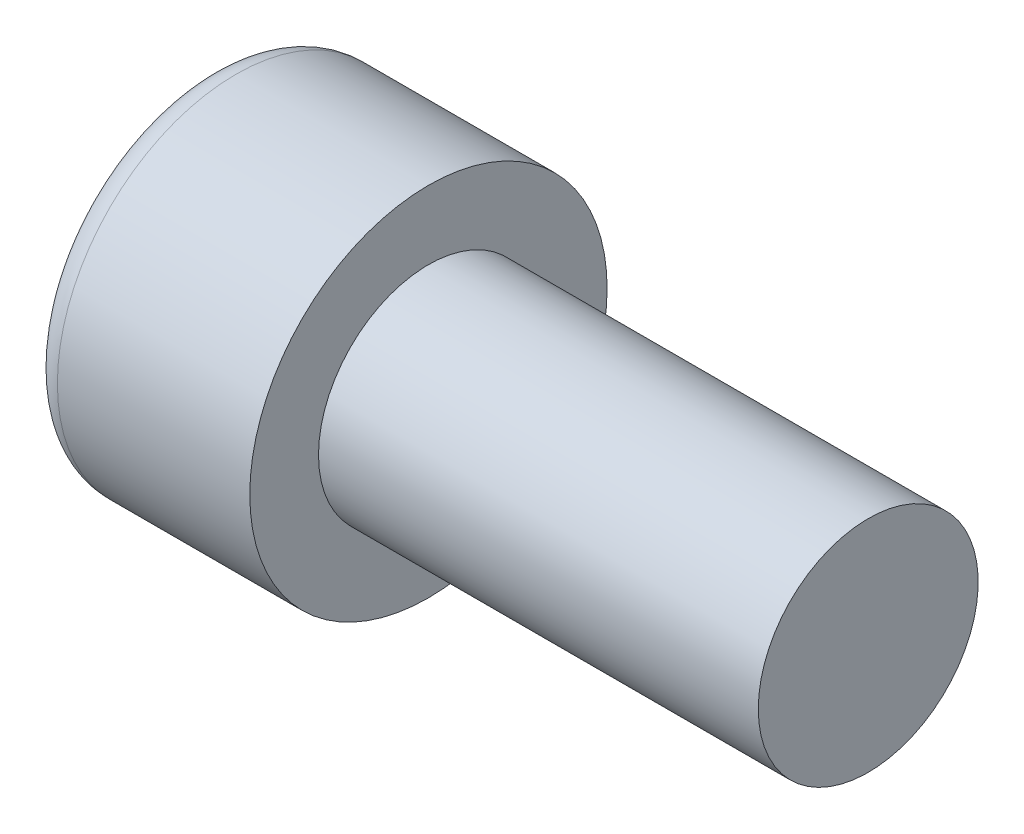
ISO-10303-21;
HEADER;
FILE_DESCRIPTION(('STEP AP214'),'2;1');
FILE_NAME('part.step','',(''),(''),'','','');
FILE_SCHEMA(('AUTOMOTIVE_DESIGN { 1 0 10303 214 1 1 1 1 }'));
ENDSEC;
DATA;
#1=APPLICATION_CONTEXT('core data for automotive mechanical design processes');
#2=APPLICATION_PROTOCOL_DEFINITION('international standard','automotive_design',2000,#1);
#3=PRODUCT_CONTEXT('',#1,'mechanical');
#4=PRODUCT('Part','Part','',(#3));
#5=PRODUCT_RELATED_PRODUCT_CATEGORY('part','',(#4));
#6=PRODUCT_DEFINITION_FORMATION('','',#4);
#7=PRODUCT_DEFINITION_CONTEXT('part definition',#1,'design');
#8=PRODUCT_DEFINITION('design','',#6,#7);
#9=PRODUCT_DEFINITION_SHAPE('','',#8);
#10=(LENGTH_UNIT() NAMED_UNIT(*) SI_UNIT(.MILLI.,.METRE.));
#11=(NAMED_UNIT(*) PLANE_ANGLE_UNIT() SI_UNIT($,.RADIAN.));
#12=(NAMED_UNIT(*) SI_UNIT($,.STERADIAN.) SOLID_ANGLE_UNIT());
#13=UNCERTAINTY_MEASURE_WITH_UNIT(LENGTH_MEASURE(1.E-05),#10,'distance_accuracy_value','');
#14=(GEOMETRIC_REPRESENTATION_CONTEXT(3) GLOBAL_UNCERTAINTY_ASSIGNED_CONTEXT((#13)) GLOBAL_UNIT_ASSIGNED_CONTEXT((#10,
#11,#12)) REPRESENTATION_CONTEXT('',''));
#15=CARTESIAN_POINT('',(0.,0.,0.));
#16=DIRECTION('',(0.,0.,1.));
#17=DIRECTION('',(1.,0.,0.));
#18=AXIS2_PLACEMENT_3D('',#15,#16,#17);
#19=CARTESIAN_POINT('',(-8.,0.,0.));
#20=DIRECTION('',(1.,0.,0.));
#21=DIRECTION('',(0.,0.,-1.));
#22=AXIS2_PLACEMENT_3D('',#19,#20,#21);
#23=PLANE('',#22);
#24=DIRECTION('',(0.,0.5,0.866025403784439));
#25=VECTOR('',#24,1.);
#26=CARTESIAN_POINT('',(-8.,-2.7712812921102,1.6));
#27=LINE('',#26,#25);
#28=CARTESIAN_POINT('',(-8.,-1.8475208614068,3.2));
#29=VERTEX_POINT('',#28);
#30=CARTESIAN_POINT('',(-8.,-3.6950417228136,0.));
#31=VERTEX_POINT('',#30);
#32=EDGE_CURVE('E178',#29,#31,#27,.F.);
#33=ORIENTED_EDGE('',*,*,#32,.T.);
#34=DIRECTION('',(0.,-0.5,0.866025403784439));
#35=VECTOR('',#34,1.);
#36=CARTESIAN_POINT('',(-8.,-2.7712812921102,-1.6));
#37=LINE('',#36,#35);
#38=CARTESIAN_POINT('',(-8.,-1.8475208614068,-3.2));
#39=VERTEX_POINT('',#38);
#40=EDGE_CURVE('E180',#31,#39,#37,.F.);
#41=ORIENTED_EDGE('',*,*,#40,.T.);
#42=DIRECTION('',(0.,-1.,0.));
#43=VECTOR('',#42,1.);
#44=CARTESIAN_POINT('',(-8.,0.,-3.2));
#45=LINE('',#44,#43);
#46=CARTESIAN_POINT('',(-8.,1.84752086140681,-3.2));
#47=VERTEX_POINT('',#46);
#48=EDGE_CURVE('E170',#39,#47,#45,.F.);
#49=ORIENTED_EDGE('',*,*,#48,.T.);
#50=DIRECTION('',(0.,-0.5,-0.866025403784439));
#51=VECTOR('',#50,1.);
#52=CARTESIAN_POINT('',(-8.,2.7712812921102,-1.6));
#53=LINE('',#52,#51);
#54=CARTESIAN_POINT('',(-8.,3.69504172281361,0.));
#55=VERTEX_POINT('',#54);
#56=EDGE_CURVE('E172',#47,#55,#53,.F.);
#57=ORIENTED_EDGE('',*,*,#56,.T.);
#58=DIRECTION('',(0.,0.5,-0.866025403784439));
#59=VECTOR('',#58,1.);
#60=CARTESIAN_POINT('',(-8.,2.7712812921102,1.6));
#61=LINE('',#60,#59);
#62=CARTESIAN_POINT('',(-8.,1.84752086140681,3.2));
#63=VERTEX_POINT('',#62);
#64=EDGE_CURVE('E174',#55,#63,#61,.F.);
#65=ORIENTED_EDGE('',*,*,#64,.T.);
#66=DIRECTION('',(0.,1.,0.));
#67=VECTOR('',#66,1.);
#68=CARTESIAN_POINT('',(-8.,0.,3.2));
#69=LINE('',#68,#67);
#70=EDGE_CURVE('E176',#63,#29,#69,.F.);
#71=ORIENTED_EDGE('',*,*,#70,.T.);
#72=EDGE_LOOP('',(#33,#41,#49,#57,#65,#71));
#73=FACE_BOUND('',#72,.T.);
#74=CARTESIAN_POINT('',(-8.,0.,0.));
#75=DIRECTION('',(1.,0.,0.));
#76=DIRECTION('',(0.,0.,-1.));
#77=AXIS2_PLACEMENT_3D('',#74,#75,#76);
#78=CIRCLE('',#77,5.5);
#79=CARTESIAN_POINT('',(-8.,0.,-5.5));
#80=VERTEX_POINT('',#79);
#81=EDGE_CURVE('E163',#80,#80,#78,.F.);
#82=ORIENTED_EDGE('',*,*,#81,.T.);
#83=EDGE_LOOP('',(#82));
#84=FACE_BOUND('',#83,.T.);
#85=ADVANCED_FACE('F36',(#73,#84),#23,.F.);
#86=CARTESIAN_POINT('',(-351.589582302374,0.,0.));
#87=DIRECTION('',(-1.,0.,0.));
#88=DIRECTION('',(0.,0.,1.));
#89=AXIS2_PLACEMENT_3D('',#86,#87,#88);
#90=CYLINDRICAL_SURFACE('',#89,6.5);
#91=CARTESIAN_POINT('',(-7.00000000000001,0.,0.));
#92=DIRECTION('',(1.,0.,0.));
#93=DIRECTION('',(0.,0.,-1.));
#94=AXIS2_PLACEMENT_3D('',#91,#92,#93);
#95=CIRCLE('',#94,6.5);
#96=CARTESIAN_POINT('',(-7.00000000000001,0.,-6.5));
#97=VERTEX_POINT('',#96);
#98=EDGE_CURVE('E166',#97,#97,#95,.T.);
#99=ORIENTED_EDGE('',*,*,#98,.T.);
#100=EDGE_LOOP('',(#99));
#101=FACE_BOUND('',#100,.T.);
#102=CARTESIAN_POINT('',(0.,0.,0.));
#103=DIRECTION('',(-1.,0.,0.));
#104=DIRECTION('',(0.,0.,1.));
#105=AXIS2_PLACEMENT_3D('',#102,#103,#104);
#106=CIRCLE('',#105,6.5);
#107=CARTESIAN_POINT('',(0.,0.,6.5));
#108=VERTEX_POINT('',#107);
#109=EDGE_CURVE('E160',#108,#108,#106,.T.);
#110=ORIENTED_EDGE('',*,*,#109,.T.);
#111=EDGE_LOOP('',(#110));
#112=FACE_BOUND('',#111,.T.);
#113=ADVANCED_FACE('F234',(#101,#112),#90,.T.);
#114=CARTESIAN_POINT('',(0.,6.5,0.));
#115=DIRECTION('',(-1.,0.,0.));
#116=DIRECTION('',(0.,0.,1.));
#117=AXIS2_PLACEMENT_3D('',#114,#115,#116);
#118=PLANE('',#117);
#119=ORIENTED_EDGE('',*,*,#109,.F.);
#120=EDGE_LOOP('',(#119));
#121=FACE_BOUND('',#120,.T.);
#122=CARTESIAN_POINT('',(0.,0.,0.));
#123=DIRECTION('',(-1.,0.,0.));
#124=DIRECTION('',(0.,0.,1.));
#125=AXIS2_PLACEMENT_3D('',#122,#123,#124);
#126=CIRCLE('',#125,4.00000000000003);
#127=CARTESIAN_POINT('',(0.,0.,4.00000000000003));
#128=VERTEX_POINT('',#127);
#129=EDGE_CURVE('E157',#128,#128,#126,.T.);
#130=ORIENTED_EDGE('',*,*,#129,.T.);
#131=EDGE_LOOP('',(#130));
#132=FACE_BOUND('',#131,.T.);
#133=ADVANCED_FACE('F240',(#121,#132),#118,.F.);
#134=CARTESIAN_POINT('',(-351.589582302374,0.,0.));
#135=DIRECTION('',(-1.,0.,0.));
#136=DIRECTION('',(0.,0.,1.));
#137=AXIS2_PLACEMENT_3D('',#134,#135,#136);
#138=CYLINDRICAL_SURFACE('',#137,4.00000000000002);
#139=ORIENTED_EDGE('',*,*,#129,.F.);
#140=EDGE_LOOP('',(#139));
#141=FACE_BOUND('',#140,.T.);
#142=CARTESIAN_POINT('',(16.,0.,0.));
#143=DIRECTION('',(-1.,0.,0.));
#144=DIRECTION('',(0.,0.,1.));
#145=AXIS2_PLACEMENT_3D('',#142,#143,#144);
#146=CIRCLE('',#145,4.);
#147=CARTESIAN_POINT('',(16.,0.,4.));
#148=VERTEX_POINT('',#147);
#149=EDGE_CURVE('E147',#148,#148,#146,.T.);
#150=ORIENTED_EDGE('',*,*,#149,.T.);
#151=EDGE_LOOP('',(#150));
#152=FACE_BOUND('',#151,.T.);
#153=ADVANCED_FACE('F325',(#141,#152),#138,.T.);
#154=CARTESIAN_POINT('',(16.,4.,0.));
#155=DIRECTION('',(-1.,0.,0.));
#156=DIRECTION('',(0.,0.,1.));
#157=AXIS2_PLACEMENT_3D('',#154,#155,#156);
#158=PLANE('',#157);
#159=ORIENTED_EDGE('',*,*,#149,.F.);
#160=EDGE_LOOP('',(#159));
#161=FACE_BOUND('',#160,.T.);
#162=ADVANCED_FACE('F316',(#161),#158,.F.);
#163=CARTESIAN_POINT('',(-4.,-1.73205080756888,-3.));
#164=DIRECTION('',(0.,-0.866025403784439,-0.5));
#165=DIRECTION('',(0.,0.5,-0.866025403784439));
#166=AXIS2_PLACEMENT_3D('',#163,#164,#165);
#167=PLANE('',#166);
#168=DIRECTION('',(-1.,0.,0.));
#169=VECTOR('',#168,1.);
#170=CARTESIAN_POINT('',(-4.,-1.73205080756888,-3.));
#171=LINE('',#170,#169);
#172=CARTESIAN_POINT('',(-4.,-1.73205080756888,-3.));
#173=VERTEX_POINT('',#172);
#174=CARTESIAN_POINT('',(-7.8,-1.73205080756888,-3.));
#175=VERTEX_POINT('',#174);
#176=EDGE_CURVE('E145',#173,#175,#171,.T.);
#177=ORIENTED_EDGE('',*,*,#176,.T.);
#178=DIRECTION('',(0.,-0.5,0.866025403784439));
#179=VECTOR('',#178,1.);
#180=CARTESIAN_POINT('',(-7.8,-1.73205080756888,-3.));
#181=LINE('',#180,#179);
#182=CARTESIAN_POINT('',(-7.8,-3.46410161513776,0.));
#183=VERTEX_POINT('',#182);
#184=EDGE_CURVE('E117',#175,#183,#181,.T.);
#185=ORIENTED_EDGE('',*,*,#184,.T.);
#186=DIRECTION('',(-1.,0.,0.));
#187=VECTOR('',#186,1.);
#188=CARTESIAN_POINT('',(-4.,-3.46410161513776,0.));
#189=LINE('',#188,#187);
#190=CARTESIAN_POINT('',(-4.,-3.46410161513776,0.));
#191=VERTEX_POINT('',#190);
#192=EDGE_CURVE('E109',#191,#183,#189,.T.);
#193=ORIENTED_EDGE('',*,*,#192,.F.);
#194=DIRECTION('',(0.,-0.5,0.866025403784438));
#195=VECTOR('',#194,1.);
#196=CARTESIAN_POINT('',(-4.,-1.73205080756888,-3.));
#197=LINE('',#196,#195);
#198=EDGE_CURVE('E114',#173,#191,#197,.T.);
#199=ORIENTED_EDGE('',*,*,#198,.F.);
#200=EDGE_LOOP('',(#177,#185,#193,#199));
#201=FACE_BOUND('',#200,.T.);
#202=ADVANCED_FACE('F112',(#201),#167,.F.);
#203=CARTESIAN_POINT('',(-4.,1.73205080756888,-3.));
#204=DIRECTION('',(0.,0.,-1.));
#205=DIRECTION('',(-1.,0.,0.));
#206=AXIS2_PLACEMENT_3D('',#203,#204,#205);
#207=PLANE('',#206);
#208=DIRECTION('',(-1.,0.,0.));
#209=VECTOR('',#208,1.);
#210=CARTESIAN_POINT('',(-4.,1.73205080756888,-3.));
#211=LINE('',#210,#209);
#212=CARTESIAN_POINT('',(-4.,1.73205080756888,-3.));
#213=VERTEX_POINT('',#212);
#214=CARTESIAN_POINT('',(-7.8,1.73205080756888,-3.));
#215=VERTEX_POINT('',#214);
#216=EDGE_CURVE('E148',#213,#215,#211,.T.);
#217=ORIENTED_EDGE('',*,*,#216,.T.);
#218=DIRECTION('',(0.,-1.,0.));
#219=VECTOR('',#218,1.);
#220=CARTESIAN_POINT('',(-7.8,1.73205080756888,-3.));
#221=LINE('',#220,#219);
#222=EDGE_CURVE('E11',#215,#175,#221,.T.);
#223=ORIENTED_EDGE('',*,*,#222,.T.);
#224=ORIENTED_EDGE('',*,*,#176,.F.);
#225=DIRECTION('',(0.,-1.,0.));
#226=VECTOR('',#225,1.);
#227=CARTESIAN_POINT('',(-4.,1.73205080756888,-3.));
#228=LINE('',#227,#226);
#229=EDGE_CURVE('E120',#213,#173,#228,.T.);
#230=ORIENTED_EDGE('',*,*,#229,.F.);
#231=EDGE_LOOP('',(#217,#223,#224,#230));
#232=FACE_BOUND('',#231,.T.);
#233=ADVANCED_FACE('F218',(#232),#207,.F.);
#234=CARTESIAN_POINT('',(-4.,3.46410161513776,0.));
#235=DIRECTION('',(0.,0.866025403784439,-0.5));
#236=DIRECTION('',(0.,0.5,0.866025403784439));
#237=AXIS2_PLACEMENT_3D('',#234,#235,#236);
#238=PLANE('',#237);
#239=DIRECTION('',(-1.,0.,0.));
#240=VECTOR('',#239,1.);
#241=CARTESIAN_POINT('',(-4.,3.46410161513776,0.));
#242=LINE('',#241,#240);
#243=CARTESIAN_POINT('',(-4.,3.46410161513776,0.));
#244=VERTEX_POINT('',#243);
#245=CARTESIAN_POINT('',(-7.8,3.46410161513776,0.));
#246=VERTEX_POINT('',#245);
#247=EDGE_CURVE('E150',#244,#246,#242,.T.);
#248=ORIENTED_EDGE('',*,*,#247,.T.);
#249=DIRECTION('',(0.,-0.5,-0.866025403784439));
#250=VECTOR('',#249,1.);
#251=CARTESIAN_POINT('',(-7.8,3.46410161513776,0.));
#252=LINE('',#251,#250);
#253=EDGE_CURVE('E45',#246,#215,#252,.T.);
#254=ORIENTED_EDGE('',*,*,#253,.T.);
#255=ORIENTED_EDGE('',*,*,#216,.F.);
#256=DIRECTION('',(0.,-0.5,-0.866025403784438));
#257=VECTOR('',#256,1.);
#258=CARTESIAN_POINT('',(-4.,3.46410161513776,0.));
#259=LINE('',#258,#257);
#260=EDGE_CURVE('E142',#244,#213,#259,.T.);
#261=ORIENTED_EDGE('',*,*,#260,.F.);
#262=EDGE_LOOP('',(#248,#254,#255,#261));
#263=FACE_BOUND('',#262,.T.);
#264=ADVANCED_FACE('F220',(#263),#238,.F.);
#265=CARTESIAN_POINT('',(-4.,1.73205080756888,3.));
#266=DIRECTION('',(0.,0.866025403784439,0.5));
#267=DIRECTION('',(0.,-0.5,0.866025403784439));
#268=AXIS2_PLACEMENT_3D('',#265,#266,#267);
#269=PLANE('',#268);
#270=DIRECTION('',(-1.,0.,0.));
#271=VECTOR('',#270,1.);
#272=CARTESIAN_POINT('',(-4.,1.73205080756888,3.));
#273=LINE('',#272,#271);
#274=CARTESIAN_POINT('',(-4.,1.73205080756888,3.));
#275=VERTEX_POINT('',#274);
#276=CARTESIAN_POINT('',(-7.8,1.73205080756888,3.));
#277=VERTEX_POINT('',#276);
#278=EDGE_CURVE('E152',#275,#277,#273,.T.);
#279=ORIENTED_EDGE('',*,*,#278,.T.);
#280=DIRECTION('',(0.,0.5,-0.866025403784439));
#281=VECTOR('',#280,1.);
#282=CARTESIAN_POINT('',(-7.8,1.73205080756888,3.));
#283=LINE('',#282,#281);
#284=EDGE_CURVE('E60',#277,#246,#283,.T.);
#285=ORIENTED_EDGE('',*,*,#284,.T.);
#286=ORIENTED_EDGE('',*,*,#247,.F.);
#287=DIRECTION('',(0.,0.5,-0.866025403784439));
#288=VECTOR('',#287,1.);
#289=CARTESIAN_POINT('',(-4.,1.73205080756888,3.));
#290=LINE('',#289,#288);
#291=EDGE_CURVE('E139',#275,#244,#290,.T.);
#292=ORIENTED_EDGE('',*,*,#291,.F.);
#293=EDGE_LOOP('',(#279,#285,#286,#292));
#294=FACE_BOUND('',#293,.T.);
#295=ADVANCED_FACE('F222',(#294),#269,.F.);
#296=CARTESIAN_POINT('',(-4.,-1.73205080756888,3.));
#297=DIRECTION('',(0.,0.,1.));
#298=DIRECTION('',(0.,-1.,0.));
#299=AXIS2_PLACEMENT_3D('',#296,#297,#298);
#300=PLANE('',#299);
#301=DIRECTION('',(-1.,0.,0.));
#302=VECTOR('',#301,1.);
#303=CARTESIAN_POINT('',(-4.,-1.73205080756888,3.));
#304=LINE('',#303,#302);
#305=CARTESIAN_POINT('',(-4.,-1.73205080756888,3.));
#306=VERTEX_POINT('',#305);
#307=CARTESIAN_POINT('',(-7.8,-1.73205080756888,3.));
#308=VERTEX_POINT('',#307);
#309=EDGE_CURVE('E119',#306,#308,#304,.T.);
#310=ORIENTED_EDGE('',*,*,#309,.T.);
#311=DIRECTION('',(0.,1.,0.));
#312=VECTOR('',#311,1.);
#313=CARTESIAN_POINT('',(-7.8,-1.73205080756888,3.));
#314=LINE('',#313,#312);
#315=EDGE_CURVE('E185',#308,#277,#314,.T.);
#316=ORIENTED_EDGE('',*,*,#315,.T.);
#317=ORIENTED_EDGE('',*,*,#278,.F.);
#318=DIRECTION('',(0.,1.,0.));
#319=VECTOR('',#318,1.);
#320=CARTESIAN_POINT('',(-4.,-1.73205080756888,3.));
#321=LINE('',#320,#319);
#322=EDGE_CURVE('E129',#306,#275,#321,.T.);
#323=ORIENTED_EDGE('',*,*,#322,.F.);
#324=EDGE_LOOP('',(#310,#316,#317,#323));
#325=FACE_BOUND('',#324,.T.);
#326=ADVANCED_FACE('F224',(#325),#300,.F.);
#327=CARTESIAN_POINT('',(-4.,-3.46410161513776,0.));
#328=DIRECTION('',(0.,-0.866025403784439,0.5));
#329=DIRECTION('',(0.,-0.5,-0.866025403784439));
#330=AXIS2_PLACEMENT_3D('',#327,#328,#329);
#331=PLANE('',#330);
#332=ORIENTED_EDGE('',*,*,#192,.T.);
#333=DIRECTION('',(0.,0.5,0.866025403784439));
#334=VECTOR('',#333,1.);
#335=CARTESIAN_POINT('',(-7.8,-3.46410161513776,0.));
#336=LINE('',#335,#334);
#337=EDGE_CURVE('E183',#183,#308,#336,.T.);
#338=ORIENTED_EDGE('',*,*,#337,.T.);
#339=ORIENTED_EDGE('',*,*,#309,.F.);
#340=DIRECTION('',(0.,0.5,0.866025403784439));
#341=VECTOR('',#340,1.);
#342=CARTESIAN_POINT('',(-4.,-3.46410161513776,0.));
#343=LINE('',#342,#341);
#344=EDGE_CURVE('E123',#191,#306,#343,.T.);
#345=ORIENTED_EDGE('',*,*,#344,.F.);
#346=EDGE_LOOP('',(#332,#338,#339,#345));
#347=FACE_BOUND('',#346,.T.);
#348=ADVANCED_FACE('F124',(#347),#331,.F.);
#349=CARTESIAN_POINT('',(-4.,0.,0.));
#350=DIRECTION('',(-1.,0.,0.));
#351=DIRECTION('',(0.,0.,1.));
#352=AXIS2_PLACEMENT_3D('',#349,#350,#351);
#353=PLANE('',#352);
#354=ORIENTED_EDGE('',*,*,#198,.T.);
#355=ORIENTED_EDGE('',*,*,#344,.T.);
#356=ORIENTED_EDGE('',*,*,#322,.T.);
#357=ORIENTED_EDGE('',*,*,#291,.T.);
#358=ORIENTED_EDGE('',*,*,#260,.T.);
#359=ORIENTED_EDGE('',*,*,#229,.T.);
#360=EDGE_LOOP('',(#354,#355,#356,#357,#358,#359));
#361=FACE_BOUND('',#360,.T.);
#362=ADVANCED_FACE('F131',(#361),#353,.T.);
#363=CARTESIAN_POINT('',(-7.00000000000001,0.,0.));
#364=DIRECTION('',(1.,0.,0.));
#365=DIRECTION('',(0.,0.,-1.));
#366=AXIS2_PLACEMENT_3D('',#363,#364,#365);
#367=TOROIDAL_SURFACE('',#366,5.5,1.);
#368=ORIENTED_EDGE('',*,*,#98,.F.);
#369=EDGE_LOOP('',(#368));
#370=FACE_BOUND('',#369,.T.);
#371=ORIENTED_EDGE('',*,*,#81,.F.);
#372=EDGE_LOOP('',(#371));
#373=FACE_BOUND('',#372,.T.);
#374=ADVANCED_FACE('F246',(#370,#373),#367,.T.);
#375=CARTESIAN_POINT('',(-7.8,1.90525588832577,3.1));
#376=DIRECTION('',(0.,0.5,-0.866025403784439));
#377=DIRECTION('',(0.,0.866025403784439,0.5));
#378=AXIS2_PLACEMENT_3D('',#375,#376,#377);
#379=CYLINDRICAL_SURFACE('',#378,0.2);
#380=CARTESIAN_POINT('',(-7.8,1.84752086140681,3.2));
#381=DIRECTION('',(0.,0.866025403784439,-0.5));
#382=DIRECTION('',(0.,0.5,0.866025403784439));
#383=AXIS2_PLACEMENT_3D('',#380,#381,#382);
#384=ELLIPSE('',#383,0.23094010767585,0.2);
#385=EDGE_CURVE('E136',#63,#277,#384,.F.);
#386=ORIENTED_EDGE('',*,*,#385,.F.);
#387=ORIENTED_EDGE('',*,*,#64,.F.);
#388=CARTESIAN_POINT('',(-7.8,3.69504172281361,0.));
#389=DIRECTION('',(0.,0.,-1.));
#390=DIRECTION('',(0.,1.,0.));
#391=AXIS2_PLACEMENT_3D('',#388,#389,#390);
#392=ELLIPSE('',#391,0.23094010767585,0.2);
#393=EDGE_CURVE('E40',#246,#55,#392,.T.);
#394=ORIENTED_EDGE('',*,*,#393,.F.);
#395=ORIENTED_EDGE('',*,*,#284,.F.);
#396=EDGE_LOOP('',(#386,#387,#394,#395));
#397=FACE_BOUND('',#396,.T.);
#398=ADVANCED_FACE('F38',(#397),#379,.T.);
#399=CARTESIAN_POINT('',(-7.8,3.63730669589464,-0.0999999999999994));
#400=DIRECTION('',(0.,-0.5,-0.866025403784439));
#401=DIRECTION('',(0.,0.866025403784439,-0.5));
#402=AXIS2_PLACEMENT_3D('',#399,#400,#401);
#403=CYLINDRICAL_SURFACE('',#402,0.2);
#404=ORIENTED_EDGE('',*,*,#393,.T.);
#405=ORIENTED_EDGE('',*,*,#56,.F.);
#406=CARTESIAN_POINT('',(-7.8,1.84752086140681,-3.2));
#407=DIRECTION('',(0.,-0.866025403784439,-0.5));
#408=DIRECTION('',(0.,0.5,-0.866025403784439));
#409=AXIS2_PLACEMENT_3D('',#406,#407,#408);
#410=ELLIPSE('',#409,0.23094010767585,0.2);
#411=EDGE_CURVE('E196',#215,#47,#410,.T.);
#412=ORIENTED_EDGE('',*,*,#411,.F.);
#413=ORIENTED_EDGE('',*,*,#253,.F.);
#414=EDGE_LOOP('',(#404,#405,#412,#413));
#415=FACE_BOUND('',#414,.T.);
#416=ADVANCED_FACE('F211',(#415),#403,.T.);
#417=CARTESIAN_POINT('',(-7.8,-1.73205080756888,3.2));
#418=DIRECTION('',(0.,1.,0.));
#419=DIRECTION('',(0.,0.,1.));
#420=AXIS2_PLACEMENT_3D('',#417,#418,#419);
#421=CYLINDRICAL_SURFACE('',#420,0.2);
#422=ORIENTED_EDGE('',*,*,#385,.T.);
#423=ORIENTED_EDGE('',*,*,#315,.F.);
#424=CARTESIAN_POINT('',(-7.8,-1.8475208614068,3.2));
#425=DIRECTION('',(0.,0.866025403784439,0.5));
#426=DIRECTION('',(0.,-0.5,0.866025403784439));
#427=AXIS2_PLACEMENT_3D('',#424,#425,#426);
#428=ELLIPSE('',#427,0.23094010767585,0.2);
#429=EDGE_CURVE('E193',#29,#308,#428,.F.);
#430=ORIENTED_EDGE('',*,*,#429,.F.);
#431=ORIENTED_EDGE('',*,*,#70,.F.);
#432=EDGE_LOOP('',(#422,#423,#430,#431));
#433=FACE_BOUND('',#432,.T.);
#434=ADVANCED_FACE('F203',(#433),#421,.T.);
#435=CARTESIAN_POINT('',(-7.8,1.73205080756888,-3.2));
#436=DIRECTION('',(0.,-1.,0.));
#437=DIRECTION('',(0.,0.,-1.));
#438=AXIS2_PLACEMENT_3D('',#435,#436,#437);
#439=CYLINDRICAL_SURFACE('',#438,0.2);
#440=ORIENTED_EDGE('',*,*,#411,.T.);
#441=ORIENTED_EDGE('',*,*,#48,.F.);
#442=CARTESIAN_POINT('',(-7.8,-1.8475208614068,-3.2));
#443=DIRECTION('',(0.,-0.866025403784439,0.5));
#444=DIRECTION('',(0.,0.5,0.866025403784439));
#445=AXIS2_PLACEMENT_3D('',#442,#443,#444);
#446=ELLIPSE('',#445,0.23094010767585,0.2);
#447=EDGE_CURVE('E191',#175,#39,#446,.T.);
#448=ORIENTED_EDGE('',*,*,#447,.F.);
#449=ORIENTED_EDGE('',*,*,#222,.F.);
#450=EDGE_LOOP('',(#440,#441,#448,#449));
#451=FACE_BOUND('',#450,.T.);
#452=ADVANCED_FACE('F216',(#451),#439,.T.);
#453=CARTESIAN_POINT('',(-7.8,-3.63730669589464,0.0999999999999994));
#454=DIRECTION('',(0.,0.5,0.866025403784439));
#455=DIRECTION('',(0.,-0.866025403784439,0.5));
#456=AXIS2_PLACEMENT_3D('',#453,#454,#455);
#457=CYLINDRICAL_SURFACE('',#456,0.2);
#458=ORIENTED_EDGE('',*,*,#429,.T.);
#459=ORIENTED_EDGE('',*,*,#337,.F.);
#460=CARTESIAN_POINT('',(-7.8,-3.6950417228136,0.));
#461=DIRECTION('',(0.,0.,1.));
#462=DIRECTION('',(0.,-1.,0.));
#463=AXIS2_PLACEMENT_3D('',#460,#461,#462);
#464=ELLIPSE('',#463,0.23094010767585,0.2);
#465=EDGE_CURVE('E189',#31,#183,#464,.F.);
#466=ORIENTED_EDGE('',*,*,#465,.F.);
#467=ORIENTED_EDGE('',*,*,#32,.F.);
#468=EDGE_LOOP('',(#458,#459,#466,#467));
#469=FACE_BOUND('',#468,.T.);
#470=ADVANCED_FACE('F253',(#469),#457,.T.);
#471=CARTESIAN_POINT('',(-7.8,-1.90525588832577,-3.1));
#472=DIRECTION('',(0.,-0.5,0.866025403784439));
#473=DIRECTION('',(0.,-0.866025403784439,-0.5));
#474=AXIS2_PLACEMENT_3D('',#471,#472,#473);
#475=CYLINDRICAL_SURFACE('',#474,0.2);
#476=ORIENTED_EDGE('',*,*,#447,.T.);
#477=ORIENTED_EDGE('',*,*,#40,.F.);
#478=ORIENTED_EDGE('',*,*,#465,.T.);
#479=ORIENTED_EDGE('',*,*,#184,.F.);
#480=EDGE_LOOP('',(#476,#477,#478,#479));
#481=FACE_BOUND('',#480,.T.);
#482=ADVANCED_FACE('F250',(#481),#475,.T.);
#483=CLOSED_SHELL('',(#85,#113,#133,#153,#162,#202,#233,#264,#295,#326,#348,#362,#374,#398,#416,
#434,#452,#470,#482));
#484=MANIFOLD_SOLID_BREP('B2',#483);
#485=ADVANCED_BREP_SHAPE_REPRESENTATION('',(#18,#484),#14);
#486=SHAPE_DEFINITION_REPRESENTATION(#9,#485);
ENDSEC;
END-ISO-10303-21;
